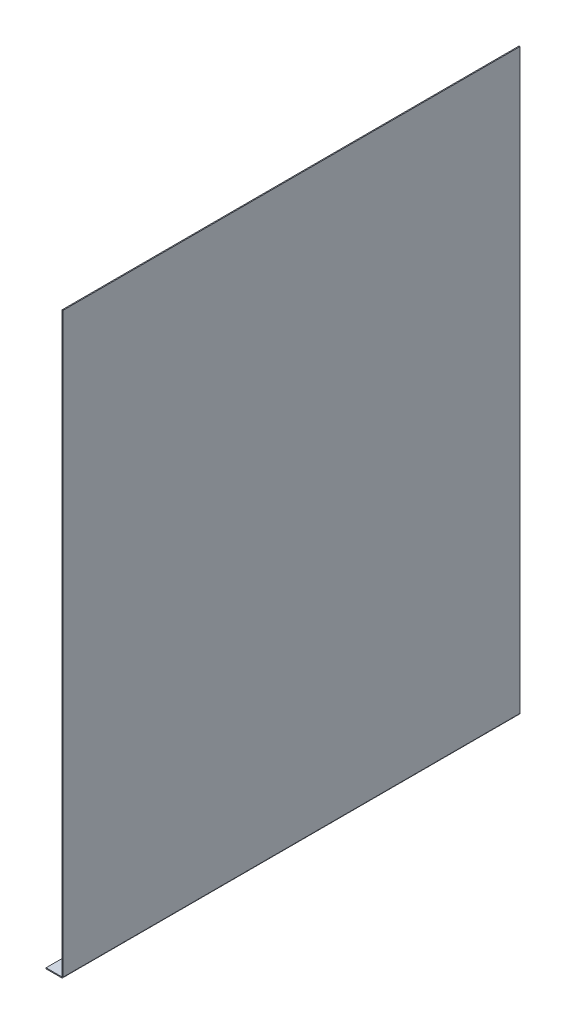
ISO-10303-21;
HEADER;
FILE_DESCRIPTION(('STEP AP214'),'2;1');
FILE_NAME('part.step','',(''),(''),'','','');
FILE_SCHEMA(('AUTOMOTIVE_DESIGN { 1 0 10303 214 1 1 1 1 }'));
ENDSEC;
DATA;
#1=APPLICATION_CONTEXT('core data for automotive mechanical design processes');
#2=APPLICATION_PROTOCOL_DEFINITION('international standard','automotive_design',2000,#1);
#3=PRODUCT_CONTEXT('',#1,'mechanical');
#4=PRODUCT('Part','Part','',(#3));
#5=PRODUCT_RELATED_PRODUCT_CATEGORY('part','',(#4));
#6=PRODUCT_DEFINITION_FORMATION('','',#4);
#7=PRODUCT_DEFINITION_CONTEXT('part definition',#1,'design');
#8=PRODUCT_DEFINITION('design','',#6,#7);
#9=PRODUCT_DEFINITION_SHAPE('','',#8);
#10=(LENGTH_UNIT() NAMED_UNIT(*) SI_UNIT(.MILLI.,.METRE.));
#11=(NAMED_UNIT(*) PLANE_ANGLE_UNIT() SI_UNIT($,.RADIAN.));
#12=(NAMED_UNIT(*) SI_UNIT($,.STERADIAN.) SOLID_ANGLE_UNIT());
#13=UNCERTAINTY_MEASURE_WITH_UNIT(LENGTH_MEASURE(1.E-05),#10,'distance_accuracy_value','');
#14=(GEOMETRIC_REPRESENTATION_CONTEXT(3) GLOBAL_UNCERTAINTY_ASSIGNED_CONTEXT((#13)) GLOBAL_UNIT_ASSIGNED_CONTEXT((#10,
#11,#12)) REPRESENTATION_CONTEXT('',''));
#15=CARTESIAN_POINT('',(0.,0.,0.));
#16=DIRECTION('',(0.,0.,1.));
#17=DIRECTION('',(1.,0.,0.));
#18=AXIS2_PLACEMENT_3D('',#15,#16,#17);
#19=CARTESIAN_POINT('',(1199.99124490111,-1200.7366,0.));
#20=DIRECTION('',(0.,0.,1.));
#21=DIRECTION('',(-1.,0.,0.));
#22=AXIS2_PLACEMENT_3D('',#19,#20,#21);
#23=PLANE('',#22);
#24=DIRECTION('',(-1.,0.,0.));
#25=VECTOR('',#24,1.);
#26=CARTESIAN_POINT('',(1199.99124490111,-1202.7366,0.));
#27=LINE('',#26,#25);
#28=CARTESIAN_POINT('',(-2.73659999999998,-1202.7366,-1.66967134562768E-13));
#29=VERTEX_POINT('',#28);
#30=CARTESIAN_POINT('',(-35.0087550988878,-1202.7366,1.11022302462516E-13));
#31=VERTEX_POINT('',#30);
#32=EDGE_CURVE('E73',#29,#31,#27,.T.);
#33=ORIENTED_EDGE('',*,*,#32,.F.);
#34=DIRECTION('',(0.,1.,0.));
#35=VECTOR('',#34,1.);
#36=CARTESIAN_POINT('',(-2.73659999999998,-1200.7366,-1.66967134562768E-13));
#37=LINE('',#36,#35);
#38=CARTESIAN_POINT('',(-2.73660000000009,-1200.7366,-6.66133814775094E-13));
#39=VERTEX_POINT('',#38);
#40=EDGE_CURVE('E113',#29,#39,#37,.T.);
#41=ORIENTED_EDGE('',*,*,#40,.T.);
#42=DIRECTION('',(-1.,0.,0.));
#43=VECTOR('',#42,1.);
#44=CARTESIAN_POINT('',(1199.99124490111,-1200.7366,0.));
#45=LINE('',#44,#43);
#46=CARTESIAN_POINT('',(-35.0087550988878,-1200.7366,1.11022302462516E-13));
#47=VERTEX_POINT('',#46);
#48=EDGE_CURVE('E52',#39,#47,#45,.T.);
#49=ORIENTED_EDGE('',*,*,#48,.T.);
#50=DIRECTION('',(0.,1.,0.));
#51=VECTOR('',#50,1.);
#52=CARTESIAN_POINT('',(-35.0087550988878,-1202.7366,1.11022302462516E-13));
#53=LINE('',#52,#51);
#54=EDGE_CURVE('E209',#31,#47,#53,.T.);
#55=ORIENTED_EDGE('',*,*,#54,.F.);
#56=EDGE_LOOP('',(#33,#41,#49,#55));
#57=FACE_BOUND('',#56,.T.);
#58=ADVANCED_FACE('F48',(#57),#23,.T.);
#59=CARTESIAN_POINT('',(1199.99124490111,-1200.7366,-950.));
#60=DIRECTION('',(0.,0.,-1.));
#61=DIRECTION('',(0.,1.,0.));
#62=AXIS2_PLACEMENT_3D('',#59,#60,#61);
#63=PLANE('',#62);
#64=DIRECTION('',(1.,0.,0.));
#65=VECTOR('',#64,1.);
#66=CARTESIAN_POINT('',(1199.99124490111,-1200.7366,-950.));
#67=LINE('',#66,#65);
#68=CARTESIAN_POINT('',(-35.0087550988878,-1200.7366,-950.));
#69=VERTEX_POINT('',#68);
#70=CARTESIAN_POINT('',(-2.73659999999998,-1200.7366,-950.));
#71=VERTEX_POINT('',#70);
#72=EDGE_CURVE('E131',#69,#71,#67,.T.);
#73=ORIENTED_EDGE('',*,*,#72,.T.);
#74=DIRECTION('',(0.,-1.,0.));
#75=VECTOR('',#74,1.);
#76=CARTESIAN_POINT('',(-2.73659999999998,-1200.7366,-950.));
#77=LINE('',#76,#75);
#78=CARTESIAN_POINT('',(-2.73659999999998,-1202.7366,-950.));
#79=VERTEX_POINT('',#78);
#80=EDGE_CURVE('E12',#71,#79,#77,.T.);
#81=ORIENTED_EDGE('',*,*,#80,.T.);
#82=DIRECTION('',(1.,0.,0.));
#83=VECTOR('',#82,1.);
#84=CARTESIAN_POINT('',(1199.99124490111,-1202.7366,-950.));
#85=LINE('',#84,#83);
#86=CARTESIAN_POINT('',(-35.0087550988878,-1202.7366,-950.));
#87=VERTEX_POINT('',#86);
#88=EDGE_CURVE('E66',#87,#79,#85,.T.);
#89=ORIENTED_EDGE('',*,*,#88,.F.);
#90=DIRECTION('',(0.,1.,0.));
#91=VECTOR('',#90,1.);
#92=CARTESIAN_POINT('',(-35.0087550988878,-1202.7366,-950.));
#93=LINE('',#92,#91);
#94=EDGE_CURVE('E206',#87,#69,#93,.T.);
#95=ORIENTED_EDGE('',*,*,#94,.T.);
#96=EDGE_LOOP('',(#73,#81,#89,#95));
#97=FACE_BOUND('',#96,.T.);
#98=ADVANCED_FACE('F50',(#97),#63,.T.);
#99=CARTESIAN_POINT('',(1199.99124490111,-1202.7366,0.));
#100=DIRECTION('',(0.,-1.,0.));
#101=DIRECTION('',(0.,0.,-1.));
#102=AXIS2_PLACEMENT_3D('',#99,#100,#101);
#103=PLANE('',#102);
#104=CARTESIAN_POINT('',(-18.8726775494439,-1202.7366,-925.));
#105=DIRECTION('',(0.,-1.,0.));
#106=DIRECTION('',(1.,0.,0.));
#107=AXIS2_PLACEMENT_3D('',#104,#105,#106);
#108=CIRCLE('',#107,4.);
#109=CARTESIAN_POINT('',(-14.8726775494439,-1202.7366,-925.));
#110=VERTEX_POINT('',#109);
#111=EDGE_CURVE('E167',#110,#110,#108,.T.);
#112=ORIENTED_EDGE('',*,*,#111,.F.);
#113=EDGE_LOOP('',(#112));
#114=FACE_BOUND('',#113,.T.);
#115=CARTESIAN_POINT('',(-18.8726775494429,-1202.7366,-825.));
#116=DIRECTION('',(0.,-1.,0.));
#117=DIRECTION('',(1.,0.,0.));
#118=AXIS2_PLACEMENT_3D('',#115,#116,#117);
#119=CIRCLE('',#118,4.);
#120=CARTESIAN_POINT('',(-14.8726775494429,-1202.7366,-825.));
#121=VERTEX_POINT('',#120);
#122=EDGE_CURVE('E300',#121,#121,#119,.T.);
#123=ORIENTED_EDGE('',*,*,#122,.F.);
#124=EDGE_LOOP('',(#123));
#125=FACE_BOUND('',#124,.T.);
#126=CARTESIAN_POINT('',(-18.8726775494418,-1202.7366,-725.));
#127=DIRECTION('',(0.,-1.,0.));
#128=DIRECTION('',(1.,0.,0.));
#129=AXIS2_PLACEMENT_3D('',#126,#127,#128);
#130=CIRCLE('',#129,4.);
#131=CARTESIAN_POINT('',(-14.8726775494418,-1202.7366,-725.));
#132=VERTEX_POINT('',#131);
#133=EDGE_CURVE('E304',#132,#132,#130,.T.);
#134=ORIENTED_EDGE('',*,*,#133,.F.);
#135=EDGE_LOOP('',(#134));
#136=FACE_BOUND('',#135,.T.);
#137=CARTESIAN_POINT('',(-18.8726775494408,-1202.7366,-625.));
#138=DIRECTION('',(0.,-1.,0.));
#139=DIRECTION('',(1.,0.,0.));
#140=AXIS2_PLACEMENT_3D('',#137,#138,#139);
#141=CIRCLE('',#140,4.);
#142=CARTESIAN_POINT('',(-14.8726775494408,-1202.7366,-625.));
#143=VERTEX_POINT('',#142);
#144=EDGE_CURVE('E308',#143,#143,#141,.T.);
#145=ORIENTED_EDGE('',*,*,#144,.F.);
#146=EDGE_LOOP('',(#145));
#147=FACE_BOUND('',#146,.T.);
#148=CARTESIAN_POINT('',(-18.8726775494398,-1202.7366,-525.));
#149=DIRECTION('',(0.,-1.,0.));
#150=DIRECTION('',(1.,0.,0.));
#151=AXIS2_PLACEMENT_3D('',#148,#149,#150);
#152=CIRCLE('',#151,4.);
#153=CARTESIAN_POINT('',(-14.8726775494398,-1202.7366,-525.));
#154=VERTEX_POINT('',#153);
#155=EDGE_CURVE('E312',#154,#154,#152,.T.);
#156=ORIENTED_EDGE('',*,*,#155,.F.);
#157=EDGE_LOOP('',(#156));
#158=FACE_BOUND('',#157,.T.);
#159=CARTESIAN_POINT('',(-18.8726775494387,-1202.7366,-425.));
#160=DIRECTION('',(0.,-1.,0.));
#161=DIRECTION('',(1.,0.,0.));
#162=AXIS2_PLACEMENT_3D('',#159,#160,#161);
#163=CIRCLE('',#162,4.);
#164=CARTESIAN_POINT('',(-14.8726775494387,-1202.7366,-425.));
#165=VERTEX_POINT('',#164);
#166=EDGE_CURVE('E316',#165,#165,#163,.T.);
#167=ORIENTED_EDGE('',*,*,#166,.F.);
#168=EDGE_LOOP('',(#167));
#169=FACE_BOUND('',#168,.T.);
#170=CARTESIAN_POINT('',(-18.8726775494377,-1202.7366,-325.));
#171=DIRECTION('',(0.,-1.,0.));
#172=DIRECTION('',(1.,0.,0.));
#173=AXIS2_PLACEMENT_3D('',#170,#171,#172);
#174=CIRCLE('',#173,4.);
#175=CARTESIAN_POINT('',(-14.8726775494377,-1202.7366,-325.));
#176=VERTEX_POINT('',#175);
#177=EDGE_CURVE('E320',#176,#176,#174,.T.);
#178=ORIENTED_EDGE('',*,*,#177,.F.);
#179=EDGE_LOOP('',(#178));
#180=FACE_BOUND('',#179,.T.);
#181=CARTESIAN_POINT('',(-18.8726775494366,-1202.7366,-225.));
#182=DIRECTION('',(0.,-1.,0.));
#183=DIRECTION('',(1.,0.,0.));
#184=AXIS2_PLACEMENT_3D('',#181,#182,#183);
#185=CIRCLE('',#184,4.);
#186=CARTESIAN_POINT('',(-14.8726775494366,-1202.7366,-225.));
#187=VERTEX_POINT('',#186);
#188=EDGE_CURVE('E324',#187,#187,#185,.T.);
#189=ORIENTED_EDGE('',*,*,#188,.F.);
#190=EDGE_LOOP('',(#189));
#191=FACE_BOUND('',#190,.T.);
#192=CARTESIAN_POINT('',(-18.8726775494356,-1202.7366,-125.));
#193=DIRECTION('',(0.,-1.,0.));
#194=DIRECTION('',(1.,0.,0.));
#195=AXIS2_PLACEMENT_3D('',#192,#193,#194);
#196=CIRCLE('',#195,4.);
#197=CARTESIAN_POINT('',(-14.8726775494356,-1202.7366,-125.));
#198=VERTEX_POINT('',#197);
#199=EDGE_CURVE('E328',#198,#198,#196,.T.);
#200=ORIENTED_EDGE('',*,*,#199,.F.);
#201=EDGE_LOOP('',(#200));
#202=FACE_BOUND('',#201,.T.);
#203=CARTESIAN_POINT('',(-18.8726775494346,-1202.7366,-25.0000000000001));
#204=DIRECTION('',(0.,-1.,0.));
#205=DIRECTION('',(1.,0.,0.));
#206=AXIS2_PLACEMENT_3D('',#203,#204,#205);
#207=CIRCLE('',#206,4.);
#208=CARTESIAN_POINT('',(-14.8726775494346,-1202.7366,-25.0000000000001));
#209=VERTEX_POINT('',#208);
#210=EDGE_CURVE('E331',#209,#209,#207,.T.);
#211=ORIENTED_EDGE('',*,*,#210,.F.);
#212=EDGE_LOOP('',(#211));
#213=FACE_BOUND('',#212,.T.);
#214=ORIENTED_EDGE('',*,*,#88,.T.);
#215=DIRECTION('',(0.,0.,1.));
#216=VECTOR('',#215,1.);
#217=CARTESIAN_POINT('',(-2.73659999999998,-1202.7366,0.));
#218=LINE('',#217,#216);
#219=EDGE_CURVE('E58',#79,#29,#218,.T.);
#220=ORIENTED_EDGE('',*,*,#219,.T.);
#221=ORIENTED_EDGE('',*,*,#32,.T.);
#222=DIRECTION('',(0.,0.,1.));
#223=VECTOR('',#222,1.);
#224=CARTESIAN_POINT('',(-35.0087550988878,-1202.7366,1.11022302462516E-13));
#225=LINE('',#224,#223);
#226=EDGE_CURVE('E202',#87,#31,#225,.T.);
#227=ORIENTED_EDGE('',*,*,#226,.F.);
#228=EDGE_LOOP('',(#214,#220,#221,#227));
#229=FACE_BOUND('',#228,.T.);
#230=ADVANCED_FACE('F244',(#114,#125,#136,#147,#158,#169,#180,#191,#202,#213,#229),#103,.T.);
#231=CARTESIAN_POINT('',(1199.99124490111,-1200.7366,0.));
#232=DIRECTION('',(0.,-1.,0.));
#233=DIRECTION('',(0.,0.,-1.));
#234=AXIS2_PLACEMENT_3D('',#231,#232,#233);
#235=PLANE('',#234);
#236=CARTESIAN_POINT('',(-18.8726775494439,-1200.7366,-925.));
#237=DIRECTION('',(0.,1.,0.));
#238=DIRECTION('',(-1.,0.,0.));
#239=AXIS2_PLACEMENT_3D('',#236,#237,#238);
#240=CIRCLE('',#239,4.);
#241=CARTESIAN_POINT('',(-22.8726775494439,-1200.7366,-925.));
#242=VERTEX_POINT('',#241);
#243=EDGE_CURVE('E334',#242,#242,#240,.T.);
#244=ORIENTED_EDGE('',*,*,#243,.F.);
#245=EDGE_LOOP('',(#244));
#246=FACE_BOUND('',#245,.T.);
#247=CARTESIAN_POINT('',(-18.8726775494429,-1200.7366,-825.));
#248=DIRECTION('',(0.,1.,0.));
#249=DIRECTION('',(-1.,0.,0.));
#250=AXIS2_PLACEMENT_3D('',#247,#248,#249);
#251=CIRCLE('',#250,4.);
#252=CARTESIAN_POINT('',(-22.8726775494429,-1200.7366,-825.));
#253=VERTEX_POINT('',#252);
#254=EDGE_CURVE('E342',#253,#253,#251,.T.);
#255=ORIENTED_EDGE('',*,*,#254,.F.);
#256=EDGE_LOOP('',(#255));
#257=FACE_BOUND('',#256,.T.);
#258=CARTESIAN_POINT('',(-18.8726775494418,-1200.7366,-725.));
#259=DIRECTION('',(0.,1.,0.));
#260=DIRECTION('',(-1.,0.,0.));
#261=AXIS2_PLACEMENT_3D('',#258,#259,#260);
#262=CIRCLE('',#261,4.);
#263=CARTESIAN_POINT('',(-22.8726775494418,-1200.7366,-725.));
#264=VERTEX_POINT('',#263);
#265=EDGE_CURVE('E378',#264,#264,#262,.T.);
#266=ORIENTED_EDGE('',*,*,#265,.F.);
#267=EDGE_LOOP('',(#266));
#268=FACE_BOUND('',#267,.T.);
#269=CARTESIAN_POINT('',(-18.8726775494408,-1200.7366,-625.));
#270=DIRECTION('',(0.,1.,0.));
#271=DIRECTION('',(-1.,0.,0.));
#272=AXIS2_PLACEMENT_3D('',#269,#270,#271);
#273=CIRCLE('',#272,4.);
#274=CARTESIAN_POINT('',(-22.8726775494408,-1200.7366,-625.));
#275=VERTEX_POINT('',#274);
#276=EDGE_CURVE('E382',#275,#275,#273,.T.);
#277=ORIENTED_EDGE('',*,*,#276,.F.);
#278=EDGE_LOOP('',(#277));
#279=FACE_BOUND('',#278,.T.);
#280=CARTESIAN_POINT('',(-18.8726775494397,-1200.7366,-525.));
#281=DIRECTION('',(0.,1.,0.));
#282=DIRECTION('',(-1.,0.,0.));
#283=AXIS2_PLACEMENT_3D('',#280,#281,#282);
#284=CIRCLE('',#283,4.);
#285=CARTESIAN_POINT('',(-22.8726775494397,-1200.7366,-525.));
#286=VERTEX_POINT('',#285);
#287=EDGE_CURVE('E386',#286,#286,#284,.T.);
#288=ORIENTED_EDGE('',*,*,#287,.F.);
#289=EDGE_LOOP('',(#288));
#290=FACE_BOUND('',#289,.T.);
#291=CARTESIAN_POINT('',(-18.8726775494387,-1200.7366,-425.));
#292=DIRECTION('',(0.,1.,0.));
#293=DIRECTION('',(-1.,0.,0.));
#294=AXIS2_PLACEMENT_3D('',#291,#292,#293);
#295=CIRCLE('',#294,4.);
#296=CARTESIAN_POINT('',(-22.8726775494387,-1200.7366,-425.));
#297=VERTEX_POINT('',#296);
#298=EDGE_CURVE('E390',#297,#297,#295,.T.);
#299=ORIENTED_EDGE('',*,*,#298,.F.);
#300=EDGE_LOOP('',(#299));
#301=FACE_BOUND('',#300,.T.);
#302=CARTESIAN_POINT('',(-18.8726775494377,-1200.7366,-325.));
#303=DIRECTION('',(0.,1.,0.));
#304=DIRECTION('',(-1.,0.,0.));
#305=AXIS2_PLACEMENT_3D('',#302,#303,#304);
#306=CIRCLE('',#305,4.);
#307=CARTESIAN_POINT('',(-22.8726775494377,-1200.7366,-325.));
#308=VERTEX_POINT('',#307);
#309=EDGE_CURVE('E394',#308,#308,#306,.T.);
#310=ORIENTED_EDGE('',*,*,#309,.F.);
#311=EDGE_LOOP('',(#310));
#312=FACE_BOUND('',#311,.T.);
#313=CARTESIAN_POINT('',(-18.8726775494366,-1200.7366,-225.));
#314=DIRECTION('',(0.,1.,0.));
#315=DIRECTION('',(-1.,0.,0.));
#316=AXIS2_PLACEMENT_3D('',#313,#314,#315);
#317=CIRCLE('',#316,4.);
#318=CARTESIAN_POINT('',(-22.8726775494366,-1200.7366,-225.));
#319=VERTEX_POINT('',#318);
#320=EDGE_CURVE('E398',#319,#319,#317,.T.);
#321=ORIENTED_EDGE('',*,*,#320,.F.);
#322=EDGE_LOOP('',(#321));
#323=FACE_BOUND('',#322,.T.);
#324=CARTESIAN_POINT('',(-18.8726775494356,-1200.7366,-125.));
#325=DIRECTION('',(0.,1.,0.));
#326=DIRECTION('',(-1.,0.,0.));
#327=AXIS2_PLACEMENT_3D('',#324,#325,#326);
#328=CIRCLE('',#327,4.);
#329=CARTESIAN_POINT('',(-22.8726775494356,-1200.7366,-125.));
#330=VERTEX_POINT('',#329);
#331=EDGE_CURVE('E402',#330,#330,#328,.T.);
#332=ORIENTED_EDGE('',*,*,#331,.F.);
#333=EDGE_LOOP('',(#332));
#334=FACE_BOUND('',#333,.T.);
#335=CARTESIAN_POINT('',(-18.8726775494346,-1200.7366,-25.0000000000001));
#336=DIRECTION('',(0.,1.,0.));
#337=DIRECTION('',(-1.,0.,0.));
#338=AXIS2_PLACEMENT_3D('',#335,#336,#337);
#339=CIRCLE('',#338,4.);
#340=CARTESIAN_POINT('',(-22.8726775494346,-1200.7366,-25.0000000000001));
#341=VERTEX_POINT('',#340);
#342=EDGE_CURVE('E345',#341,#341,#339,.T.);
#343=ORIENTED_EDGE('',*,*,#342,.F.);
#344=EDGE_LOOP('',(#343));
#345=FACE_BOUND('',#344,.T.);
#346=DIRECTION('',(0.,0.,1.));
#347=VECTOR('',#346,1.);
#348=CARTESIAN_POINT('',(-2.73659999999998,-1200.7366,0.));
#349=LINE('',#348,#347);
#350=EDGE_CURVE('E121',#71,#39,#349,.T.);
#351=ORIENTED_EDGE('',*,*,#350,.F.);
#352=ORIENTED_EDGE('',*,*,#72,.F.);
#353=DIRECTION('',(0.,0.,1.));
#354=VECTOR('',#353,1.);
#355=CARTESIAN_POINT('',(-35.0087550988878,-1200.7366,1.11022302462516E-13));
#356=LINE('',#355,#354);
#357=EDGE_CURVE('E129',#69,#47,#356,.T.);
#358=ORIENTED_EDGE('',*,*,#357,.T.);
#359=ORIENTED_EDGE('',*,*,#48,.F.);
#360=EDGE_LOOP('',(#351,#352,#358,#359));
#361=FACE_BOUND('',#360,.T.);
#362=ADVANCED_FACE('F126',(#246,#257,#268,#279,#290,#301,#312,#323,#334,#345,#361),#235,.F.);
#363=CARTESIAN_POINT('',(-35.0087550988878,-1202.7366,1.11022302462516E-13));
#364=DIRECTION('',(-1.,0.,0.));
#365=DIRECTION('',(0.,0.,-1.));
#366=AXIS2_PLACEMENT_3D('',#363,#364,#365);
#367=PLANE('',#366);
#368=ORIENTED_EDGE('',*,*,#357,.F.);
#369=ORIENTED_EDGE('',*,*,#94,.F.);
#370=ORIENTED_EDGE('',*,*,#226,.T.);
#371=ORIENTED_EDGE('',*,*,#54,.T.);
#372=EDGE_LOOP('',(#368,#369,#370,#371));
#373=FACE_BOUND('',#372,.T.);
#374=ADVANCED_FACE('F248',(#373),#367,.T.);
#375=CARTESIAN_POINT('',(-2.,0.,0.));
#376=DIRECTION('',(0.,1.,0.));
#377=DIRECTION('',(0.,0.,1.));
#378=AXIS2_PLACEMENT_3D('',#375,#376,#377);
#379=PLANE('',#378);
#380=DIRECTION('',(0.,0.,1.));
#381=VECTOR('',#380,1.);
#382=CARTESIAN_POINT('',(0.,0.,0.));
#383=LINE('',#382,#381);
#384=CARTESIAN_POINT('',(0.,0.,-950.));
#385=VERTEX_POINT('',#384);
#386=CARTESIAN_POINT('',(0.,0.,0.));
#387=VERTEX_POINT('',#386);
#388=EDGE_CURVE('E178',#385,#387,#383,.T.);
#389=ORIENTED_EDGE('',*,*,#388,.F.);
#390=DIRECTION('',(1.,0.,0.));
#391=VECTOR('',#390,1.);
#392=CARTESIAN_POINT('',(-2.,0.,-950.));
#393=LINE('',#392,#391);
#394=CARTESIAN_POINT('',(-2.,0.,-950.));
#395=VERTEX_POINT('',#394);
#396=EDGE_CURVE('E168',#395,#385,#393,.T.);
#397=ORIENTED_EDGE('',*,*,#396,.F.);
#398=DIRECTION('',(0.,0.,1.));
#399=VECTOR('',#398,1.);
#400=CARTESIAN_POINT('',(-2.,0.,0.));
#401=LINE('',#400,#399);
#402=CARTESIAN_POINT('',(-2.,0.,0.));
#403=VERTEX_POINT('',#402);
#404=EDGE_CURVE('E194',#395,#403,#401,.T.);
#405=ORIENTED_EDGE('',*,*,#404,.T.);
#406=DIRECTION('',(1.,0.,0.));
#407=VECTOR('',#406,1.);
#408=CARTESIAN_POINT('',(-2.,0.,0.));
#409=LINE('',#408,#407);
#410=EDGE_CURVE('E191',#403,#387,#409,.T.);
#411=ORIENTED_EDGE('',*,*,#410,.T.);
#412=EDGE_LOOP('',(#389,#397,#405,#411));
#413=FACE_BOUND('',#412,.T.);
#414=ADVANCED_FACE('F272',(#413),#379,.T.);
#415=CARTESIAN_POINT('',(-2.,0.,0.));
#416=DIRECTION('',(1.,0.,0.));
#417=DIRECTION('',(0.,0.,-1.));
#418=AXIS2_PLACEMENT_3D('',#415,#416,#417);
#419=PLANE('',#418);
#420=DIRECTION('',(0.,1.,0.));
#421=VECTOR('',#420,1.);
#422=CARTESIAN_POINT('',(-2.,0.,-950.));
#423=LINE('',#422,#421);
#424=CARTESIAN_POINT('',(-2.,-1200.,-950.));
#425=VERTEX_POINT('',#424);
#426=EDGE_CURVE('E172',#425,#395,#423,.T.);
#427=ORIENTED_EDGE('',*,*,#426,.F.);
#428=DIRECTION('',(0.,0.,1.));
#429=VECTOR('',#428,1.);
#430=CARTESIAN_POINT('',(-2.,-1200.,0.));
#431=LINE('',#430,#429);
#432=CARTESIAN_POINT('',(-2.,-1200.,-6.66133814775094E-13));
#433=VERTEX_POINT('',#432);
#434=EDGE_CURVE('E188',#425,#433,#431,.T.);
#435=ORIENTED_EDGE('',*,*,#434,.T.);
#436=DIRECTION('',(0.,-1.,0.));
#437=VECTOR('',#436,1.);
#438=CARTESIAN_POINT('',(-2.,0.,0.));
#439=LINE('',#438,#437);
#440=EDGE_CURVE('E185',#403,#433,#439,.T.);
#441=ORIENTED_EDGE('',*,*,#440,.F.);
#442=ORIENTED_EDGE('',*,*,#404,.F.);
#443=EDGE_LOOP('',(#427,#435,#441,#442));
#444=FACE_BOUND('',#443,.T.);
#445=ADVANCED_FACE('F270',(#444),#419,.F.);
#446=CARTESIAN_POINT('',(-2.,0.,0.));
#447=DIRECTION('',(0.,0.,1.));
#448=DIRECTION('',(0.,-1.,0.));
#449=AXIS2_PLACEMENT_3D('',#446,#447,#448);
#450=PLANE('',#449);
#451=DIRECTION('',(-1.,0.,0.));
#452=VECTOR('',#451,1.);
#453=CARTESIAN_POINT('',(-2.,-1200.,-1.66533453693773E-13));
#454=LINE('',#453,#452);
#455=CARTESIAN_POINT('',(0.,-1200.,-1.66533453693773E-13));
#456=VERTEX_POINT('',#455);
#457=EDGE_CURVE('E145',#456,#433,#454,.T.);
#458=ORIENTED_EDGE('',*,*,#457,.F.);
#459=DIRECTION('',(0.,-1.,0.));
#460=VECTOR('',#459,1.);
#461=CARTESIAN_POINT('',(0.,0.,0.));
#462=LINE('',#461,#460);
#463=EDGE_CURVE('E175',#387,#456,#462,.T.);
#464=ORIENTED_EDGE('',*,*,#463,.F.);
#465=ORIENTED_EDGE('',*,*,#410,.F.);
#466=ORIENTED_EDGE('',*,*,#440,.T.);
#467=EDGE_LOOP('',(#458,#464,#465,#466));
#468=FACE_BOUND('',#467,.T.);
#469=ADVANCED_FACE('F266',(#468),#450,.T.);
#470=CARTESIAN_POINT('',(0.,0.,0.));
#471=DIRECTION('',(1.,0.,0.));
#472=DIRECTION('',(0.,0.,-1.));
#473=AXIS2_PLACEMENT_3D('',#470,#471,#472);
#474=PLANE('',#473);
#475=DIRECTION('',(0.,0.,1.));
#476=VECTOR('',#475,1.);
#477=CARTESIAN_POINT('',(0.,-1200.,0.));
#478=LINE('',#477,#476);
#479=CARTESIAN_POINT('',(0.,-1200.,-950.));
#480=VERTEX_POINT('',#479);
#481=EDGE_CURVE('E154',#480,#456,#478,.T.);
#482=ORIENTED_EDGE('',*,*,#481,.F.);
#483=DIRECTION('',(0.,1.,0.));
#484=VECTOR('',#483,1.);
#485=CARTESIAN_POINT('',(0.,0.,-950.));
#486=LINE('',#485,#484);
#487=EDGE_CURVE('E182',#480,#385,#486,.T.);
#488=ORIENTED_EDGE('',*,*,#487,.T.);
#489=ORIENTED_EDGE('',*,*,#388,.T.);
#490=ORIENTED_EDGE('',*,*,#463,.T.);
#491=EDGE_LOOP('',(#482,#488,#489,#490));
#492=FACE_BOUND('',#491,.T.);
#493=ADVANCED_FACE('F263',(#492),#474,.T.);
#494=CARTESIAN_POINT('',(-2.,0.,-950.));
#495=DIRECTION('',(0.,0.,-1.));
#496=DIRECTION('',(-1.,0.,0.));
#497=AXIS2_PLACEMENT_3D('',#494,#495,#496);
#498=PLANE('',#497);
#499=DIRECTION('',(1.,0.,0.));
#500=VECTOR('',#499,1.);
#501=CARTESIAN_POINT('',(-2.,-1200.,-950.));
#502=LINE('',#501,#500);
#503=EDGE_CURVE('E147',#425,#480,#502,.T.);
#504=ORIENTED_EDGE('',*,*,#503,.F.);
#505=ORIENTED_EDGE('',*,*,#426,.T.);
#506=ORIENTED_EDGE('',*,*,#396,.T.);
#507=ORIENTED_EDGE('',*,*,#487,.F.);
#508=EDGE_LOOP('',(#504,#505,#506,#507));
#509=FACE_BOUND('',#508,.T.);
#510=ADVANCED_FACE('F258',(#509),#498,.T.);
#511=CARTESIAN_POINT('',(-2.73659999999998,-1200.,-950.));
#512=DIRECTION('',(0.,0.,1.));
#513=DIRECTION('',(1.,0.,0.));
#514=AXIS2_PLACEMENT_3D('',#511,#512,#513);
#515=PLANE('',#514);
#516=ORIENTED_EDGE('',*,*,#503,.T.);
#517=CARTESIAN_POINT('',(-2.73659999999998,-1200.,-950.));
#518=DIRECTION('',(0.,0.,1.));
#519=DIRECTION('',(1.,0.,0.));
#520=AXIS2_PLACEMENT_3D('',#517,#518,#519);
#521=CIRCLE('',#520,2.7366);
#522=EDGE_CURVE('E163',#480,#79,#521,.F.);
#523=ORIENTED_EDGE('',*,*,#522,.T.);
#524=ORIENTED_EDGE('',*,*,#80,.F.);
#525=CARTESIAN_POINT('',(-2.73659999999998,-1200.,-950.));
#526=DIRECTION('',(0.,0.,-1.));
#527=DIRECTION('',(1.,0.,0.));
#528=AXIS2_PLACEMENT_3D('',#525,#526,#527);
#529=CIRCLE('',#528,0.736599999999988);
#530=EDGE_CURVE('E139',#425,#71,#529,.T.);
#531=ORIENTED_EDGE('',*,*,#530,.F.);
#532=EDGE_LOOP('',(#516,#523,#524,#531));
#533=FACE_BOUND('',#532,.T.);
#534=ADVANCED_FACE('F255',(#533),#515,.F.);
#535=CARTESIAN_POINT('',(-2.73659999999998,-1200.,-6.66133814775094E-13));
#536=DIRECTION('',(0.,0.,-1.));
#537=DIRECTION('',(-1.,0.,0.));
#538=AXIS2_PLACEMENT_3D('',#535,#536,#537);
#539=PLANE('',#538);
#540=ORIENTED_EDGE('',*,*,#40,.F.);
#541=CARTESIAN_POINT('',(-2.73659999999998,-1200.,-1.11022302462516E-12));
#542=DIRECTION('',(0.,0.,1.));
#543=DIRECTION('',(1.,0.,0.));
#544=AXIS2_PLACEMENT_3D('',#541,#542,#543);
#545=CIRCLE('',#544,2.7366);
#546=EDGE_CURVE('E157',#29,#456,#545,.T.);
#547=ORIENTED_EDGE('',*,*,#546,.T.);
#548=ORIENTED_EDGE('',*,*,#457,.T.);
#549=CARTESIAN_POINT('',(-2.73659999999998,-1200.,-6.66133814775094E-13));
#550=DIRECTION('',(0.,0.,1.));
#551=DIRECTION('',(-1.,0.,0.));
#552=AXIS2_PLACEMENT_3D('',#549,#550,#551);
#553=CIRCLE('',#552,0.736599999999988);
#554=EDGE_CURVE('E137',#39,#433,#553,.T.);
#555=ORIENTED_EDGE('',*,*,#554,.F.);
#556=EDGE_LOOP('',(#540,#547,#548,#555));
#557=FACE_BOUND('',#556,.T.);
#558=ADVANCED_FACE('F143',(#557),#539,.F.);
#559=CARTESIAN_POINT('',(-2.73659999999998,-1200.,-1425.00602163239));
#560=DIRECTION('',(0.,0.,1.));
#561=DIRECTION('',(1.,0.,0.));
#562=AXIS2_PLACEMENT_3D('',#559,#560,#561);
#563=CYLINDRICAL_SURFACE('',#562,0.7366);
#564=ORIENTED_EDGE('',*,*,#554,.T.);
#565=ORIENTED_EDGE('',*,*,#434,.F.);
#566=ORIENTED_EDGE('',*,*,#530,.T.);
#567=ORIENTED_EDGE('',*,*,#350,.T.);
#568=EDGE_LOOP('',(#564,#565,#566,#567));
#569=FACE_BOUND('',#568,.T.);
#570=ADVANCED_FACE('F135',(#569),#563,.F.);
#571=CARTESIAN_POINT('',(-2.73659999999998,-1200.,-1425.00602163239));
#572=DIRECTION('',(0.,0.,1.));
#573=DIRECTION('',(1.,0.,0.));
#574=AXIS2_PLACEMENT_3D('',#571,#572,#573);
#575=CYLINDRICAL_SURFACE('',#574,2.7366);
#576=ORIENTED_EDGE('',*,*,#546,.F.);
#577=ORIENTED_EDGE('',*,*,#219,.F.);
#578=ORIENTED_EDGE('',*,*,#522,.F.);
#579=ORIENTED_EDGE('',*,*,#481,.T.);
#580=EDGE_LOOP('',(#576,#577,#578,#579));
#581=FACE_BOUND('',#580,.T.);
#582=ADVANCED_FACE('F254',(#581),#575,.T.);
#583=CARTESIAN_POINT('',(-18.8726775494346,-1203.7366,-25.0000000000001));
#584=DIRECTION('',(0.,1.,0.));
#585=DIRECTION('',(-1.,0.,0.));
#586=AXIS2_PLACEMENT_3D('',#583,#584,#585);
#587=CYLINDRICAL_SURFACE('',#586,4.);
#588=ORIENTED_EDGE('',*,*,#210,.T.);
#589=EDGE_LOOP('',(#588));
#590=FACE_BOUND('',#589,.T.);
#591=ORIENTED_EDGE('',*,*,#342,.T.);
#592=EDGE_LOOP('',(#591));
#593=FACE_BOUND('',#592,.T.);
#594=ADVANCED_FACE('F458',(#590,#593),#587,.F.);
#595=CARTESIAN_POINT('',(-18.8726775494356,-1203.7366,-125.));
#596=DIRECTION('',(0.,1.,0.));
#597=DIRECTION('',(-1.,0.,0.));
#598=AXIS2_PLACEMENT_3D('',#595,#596,#597);
#599=CYLINDRICAL_SURFACE('',#598,4.);
#600=ORIENTED_EDGE('',*,*,#199,.T.);
#601=EDGE_LOOP('',(#600));
#602=FACE_BOUND('',#601,.T.);
#603=ORIENTED_EDGE('',*,*,#331,.T.);
#604=EDGE_LOOP('',(#603));
#605=FACE_BOUND('',#604,.T.);
#606=ADVANCED_FACE('F454',(#602,#605),#599,.F.);
#607=CARTESIAN_POINT('',(-18.8726775494366,-1203.7366,-225.));
#608=DIRECTION('',(0.,1.,0.));
#609=DIRECTION('',(-1.,0.,0.));
#610=AXIS2_PLACEMENT_3D('',#607,#608,#609);
#611=CYLINDRICAL_SURFACE('',#610,4.);
#612=ORIENTED_EDGE('',*,*,#188,.T.);
#613=EDGE_LOOP('',(#612));
#614=FACE_BOUND('',#613,.T.);
#615=ORIENTED_EDGE('',*,*,#320,.T.);
#616=EDGE_LOOP('',(#615));
#617=FACE_BOUND('',#616,.T.);
#618=ADVANCED_FACE('F450',(#614,#617),#611,.F.);
#619=CARTESIAN_POINT('',(-18.8726775494377,-1203.7366,-325.));
#620=DIRECTION('',(0.,1.,0.));
#621=DIRECTION('',(-1.,0.,0.));
#622=AXIS2_PLACEMENT_3D('',#619,#620,#621);
#623=CYLINDRICAL_SURFACE('',#622,4.);
#624=ORIENTED_EDGE('',*,*,#177,.T.);
#625=EDGE_LOOP('',(#624));
#626=FACE_BOUND('',#625,.T.);
#627=ORIENTED_EDGE('',*,*,#309,.T.);
#628=EDGE_LOOP('',(#627));
#629=FACE_BOUND('',#628,.T.);
#630=ADVANCED_FACE('F446',(#626,#629),#623,.F.);
#631=CARTESIAN_POINT('',(-18.8726775494387,-1203.7366,-425.));
#632=DIRECTION('',(0.,1.,0.));
#633=DIRECTION('',(-1.,0.,0.));
#634=AXIS2_PLACEMENT_3D('',#631,#632,#633);
#635=CYLINDRICAL_SURFACE('',#634,4.);
#636=ORIENTED_EDGE('',*,*,#166,.T.);
#637=EDGE_LOOP('',(#636));
#638=FACE_BOUND('',#637,.T.);
#639=ORIENTED_EDGE('',*,*,#298,.T.);
#640=EDGE_LOOP('',(#639));
#641=FACE_BOUND('',#640,.T.);
#642=ADVANCED_FACE('F442',(#638,#641),#635,.F.);
#643=CARTESIAN_POINT('',(-18.8726775494398,-1203.7366,-525.));
#644=DIRECTION('',(0.,1.,0.));
#645=DIRECTION('',(-1.,0.,0.));
#646=AXIS2_PLACEMENT_3D('',#643,#644,#645);
#647=CYLINDRICAL_SURFACE('',#646,4.);
#648=ORIENTED_EDGE('',*,*,#155,.T.);
#649=EDGE_LOOP('',(#648));
#650=FACE_BOUND('',#649,.T.);
#651=ORIENTED_EDGE('',*,*,#287,.T.);
#652=EDGE_LOOP('',(#651));
#653=FACE_BOUND('',#652,.T.);
#654=ADVANCED_FACE('F438',(#650,#653),#647,.F.);
#655=CARTESIAN_POINT('',(-18.8726775494408,-1203.7366,-625.));
#656=DIRECTION('',(0.,1.,0.));
#657=DIRECTION('',(-1.,0.,0.));
#658=AXIS2_PLACEMENT_3D('',#655,#656,#657);
#659=CYLINDRICAL_SURFACE('',#658,4.);
#660=ORIENTED_EDGE('',*,*,#144,.T.);
#661=EDGE_LOOP('',(#660));
#662=FACE_BOUND('',#661,.T.);
#663=ORIENTED_EDGE('',*,*,#276,.T.);
#664=EDGE_LOOP('',(#663));
#665=FACE_BOUND('',#664,.T.);
#666=ADVANCED_FACE('F432',(#662,#665),#659,.F.);
#667=CARTESIAN_POINT('',(-18.8726775494418,-1203.7366,-725.));
#668=DIRECTION('',(0.,1.,0.));
#669=DIRECTION('',(-1.,0.,0.));
#670=AXIS2_PLACEMENT_3D('',#667,#668,#669);
#671=CYLINDRICAL_SURFACE('',#670,4.);
#672=ORIENTED_EDGE('',*,*,#133,.T.);
#673=EDGE_LOOP('',(#672));
#674=FACE_BOUND('',#673,.T.);
#675=ORIENTED_EDGE('',*,*,#265,.T.);
#676=EDGE_LOOP('',(#675));
#677=FACE_BOUND('',#676,.T.);
#678=ADVANCED_FACE('F426',(#674,#677),#671,.F.);
#679=CARTESIAN_POINT('',(-18.8726775494429,-1203.7366,-825.));
#680=DIRECTION('',(0.,1.,0.));
#681=DIRECTION('',(-1.,0.,0.));
#682=AXIS2_PLACEMENT_3D('',#679,#680,#681);
#683=CYLINDRICAL_SURFACE('',#682,4.);
#684=ORIENTED_EDGE('',*,*,#122,.T.);
#685=EDGE_LOOP('',(#684));
#686=FACE_BOUND('',#685,.T.);
#687=ORIENTED_EDGE('',*,*,#254,.T.);
#688=EDGE_LOOP('',(#687));
#689=FACE_BOUND('',#688,.T.);
#690=ADVANCED_FACE('F368',(#686,#689),#683,.F.);
#691=CARTESIAN_POINT('',(-18.8726775494439,-1203.7366,-925.));
#692=DIRECTION('',(0.,1.,0.));
#693=DIRECTION('',(-1.,0.,0.));
#694=AXIS2_PLACEMENT_3D('',#691,#692,#693);
#695=CYLINDRICAL_SURFACE('',#694,4.);
#696=ORIENTED_EDGE('',*,*,#111,.T.);
#697=EDGE_LOOP('',(#696));
#698=FACE_BOUND('',#697,.T.);
#699=ORIENTED_EDGE('',*,*,#243,.T.);
#700=EDGE_LOOP('',(#699));
#701=FACE_BOUND('',#700,.T.);
#702=ADVANCED_FACE('F365',(#698,#701),#695,.F.);
#703=CLOSED_SHELL('',(#58,#98,#230,#362,#374,#414,#445,#469,#493,#510,#534,#558,#570,#582,#594,
#606,#618,#630,#642,#654,#666,#678,#690,#702));
#704=MANIFOLD_SOLID_BREP('B2',#703);
#705=ADVANCED_BREP_SHAPE_REPRESENTATION('',(#18,#704),#14);
#706=SHAPE_DEFINITION_REPRESENTATION(#9,#705);
ENDSEC;
END-ISO-10303-21;
